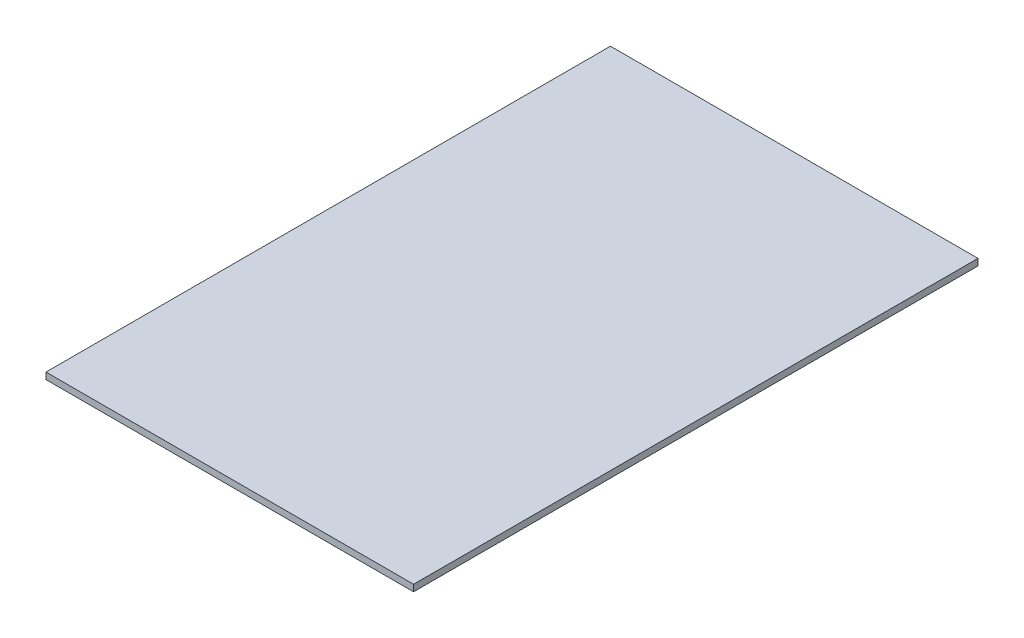
ISO-10303-21;
HEADER;
FILE_DESCRIPTION(('STEP AP214'),'2;1');
FILE_NAME('part.step','',(''),(''),'','','');
FILE_SCHEMA(('AUTOMOTIVE_DESIGN { 1 0 10303 214 1 1 1 1 }'));
ENDSEC;
DATA;
#1=APPLICATION_CONTEXT('core data for automotive mechanical design processes');
#2=APPLICATION_PROTOCOL_DEFINITION('international standard','automotive_design',2000,#1);
#3=PRODUCT_CONTEXT('',#1,'mechanical');
#4=PRODUCT('Part','Part','',(#3));
#5=PRODUCT_RELATED_PRODUCT_CATEGORY('part','',(#4));
#6=PRODUCT_DEFINITION_FORMATION('','',#4);
#7=PRODUCT_DEFINITION_CONTEXT('part definition',#1,'design');
#8=PRODUCT_DEFINITION('design','',#6,#7);
#9=PRODUCT_DEFINITION_SHAPE('','',#8);
#10=(LENGTH_UNIT() NAMED_UNIT(*) SI_UNIT(.MILLI.,.METRE.));
#11=(NAMED_UNIT(*) PLANE_ANGLE_UNIT() SI_UNIT($,.RADIAN.));
#12=(NAMED_UNIT(*) SI_UNIT($,.STERADIAN.) SOLID_ANGLE_UNIT());
#13=UNCERTAINTY_MEASURE_WITH_UNIT(LENGTH_MEASURE(1.E-05),#10,'distance_accuracy_value','');
#14=(GEOMETRIC_REPRESENTATION_CONTEXT(3) GLOBAL_UNCERTAINTY_ASSIGNED_CONTEXT((#13)) GLOBAL_UNIT_ASSIGNED_CONTEXT((#10,
#11,#12)) REPRESENTATION_CONTEXT('',''));
#15=CARTESIAN_POINT('',(0.,0.,0.));
#16=DIRECTION('',(0.,0.,1.));
#17=DIRECTION('',(1.,0.,0.));
#18=AXIS2_PLACEMENT_3D('',#15,#16,#17);
#19=CARTESIAN_POINT('',(0.,0.,0.));
#20=DIRECTION('',(0.,-1.,0.));
#21=DIRECTION('',(0.,0.,-1.));
#22=AXIS2_PLACEMENT_3D('',#19,#20,#21);
#23=PLANE('',#22);
#24=DIRECTION('',(-1.,0.,0.));
#25=VECTOR('',#24,1.);
#26=CARTESIAN_POINT('',(0.,0.,-77.5));
#27=LINE('',#26,#25);
#28=CARTESIAN_POINT('',(70.,0.,-77.5));
#29=VERTEX_POINT('',#28);
#30=CARTESIAN_POINT('',(-70.,0.,-77.5));
#31=VERTEX_POINT('',#30);
#32=EDGE_CURVE('E141',#29,#31,#27,.T.);
#33=ORIENTED_EDGE('',*,*,#32,.F.);
#34=DIRECTION('',(0.,0.,-1.));
#35=VECTOR('',#34,1.);
#36=CARTESIAN_POINT('',(70.,0.,137.5));
#37=LINE('',#36,#35);
#38=CARTESIAN_POINT('',(70.,0.,137.5));
#39=VERTEX_POINT('',#38);
#40=EDGE_CURVE('E140',#39,#29,#37,.T.);
#41=ORIENTED_EDGE('',*,*,#40,.F.);
#42=DIRECTION('',(1.,0.,0.));
#43=VECTOR('',#42,1.);
#44=CARTESIAN_POINT('',(-70.,0.,137.5));
#45=LINE('',#44,#43);
#46=CARTESIAN_POINT('',(-70.,0.,137.5));
#47=VERTEX_POINT('',#46);
#48=EDGE_CURVE('E148',#47,#39,#45,.T.);
#49=ORIENTED_EDGE('',*,*,#48,.F.);
#50=DIRECTION('',(0.,0.,1.));
#51=VECTOR('',#50,1.);
#52=CARTESIAN_POINT('',(-70.,0.,137.5));
#53=LINE('',#52,#51);
#54=EDGE_CURVE('E151',#31,#47,#53,.T.);
#55=ORIENTED_EDGE('',*,*,#54,.F.);
#56=EDGE_LOOP('',(#33,#41,#49,#55));
#57=FACE_BOUND('',#56,.T.);
#58=DIRECTION('',(1.,0.,0.));
#59=VECTOR('',#58,1.);
#60=CARTESIAN_POINT('',(-56.,0.,-18.));
#61=LINE('',#60,#59);
#62=CARTESIAN_POINT('',(-56.,0.,-18.));
#63=VERTEX_POINT('',#62);
#64=CARTESIAN_POINT('',(-14.,0.,-18.));
#65=VERTEX_POINT('',#64);
#66=EDGE_CURVE('E208',#63,#65,#61,.T.);
#67=ORIENTED_EDGE('',*,*,#66,.F.);
#68=DIRECTION('',(0.,0.,-1.));
#69=VECTOR('',#68,1.);
#70=CARTESIAN_POINT('',(-56.,0.,-18.));
#71=LINE('',#70,#69);
#72=CARTESIAN_POINT('',(-56.,0.,18.));
#73=VERTEX_POINT('',#72);
#74=EDGE_CURVE('E194',#73,#63,#71,.T.);
#75=ORIENTED_EDGE('',*,*,#74,.F.);
#76=DIRECTION('',(-1.,0.,0.));
#77=VECTOR('',#76,1.);
#78=CARTESIAN_POINT('',(-56.,0.,18.));
#79=LINE('',#78,#77);
#80=CARTESIAN_POINT('',(-14.,0.,18.));
#81=VERTEX_POINT('',#80);
#82=EDGE_CURVE('E199',#81,#73,#79,.T.);
#83=ORIENTED_EDGE('',*,*,#82,.F.);
#84=DIRECTION('',(0.,0.,1.));
#85=VECTOR('',#84,1.);
#86=CARTESIAN_POINT('',(-14.,0.,-18.));
#87=LINE('',#86,#85);
#88=EDGE_CURVE('E210',#65,#81,#87,.T.);
#89=ORIENTED_EDGE('',*,*,#88,.F.);
#90=EDGE_LOOP('',(#67,#75,#83,#89));
#91=FACE_BOUND('',#90,.T.);
#92=DIRECTION('',(0.,0.,1.));
#93=VECTOR('',#92,1.);
#94=CARTESIAN_POINT('',(56.,0.,-18.));
#95=LINE('',#94,#93);
#96=CARTESIAN_POINT('',(56.,0.,-18.));
#97=VERTEX_POINT('',#96);
#98=CARTESIAN_POINT('',(56.,0.,18.));
#99=VERTEX_POINT('',#98);
#100=EDGE_CURVE('E167',#97,#99,#95,.T.);
#101=ORIENTED_EDGE('',*,*,#100,.F.);
#102=DIRECTION('',(1.,0.,0.));
#103=VECTOR('',#102,1.);
#104=CARTESIAN_POINT('',(56.,0.,-18.));
#105=LINE('',#104,#103);
#106=CARTESIAN_POINT('',(14.,0.,-18.));
#107=VERTEX_POINT('',#106);
#108=EDGE_CURVE('E164',#107,#97,#105,.T.);
#109=ORIENTED_EDGE('',*,*,#108,.F.);
#110=DIRECTION('',(0.,0.,-1.));
#111=VECTOR('',#110,1.);
#112=CARTESIAN_POINT('',(14.,0.,-18.));
#113=LINE('',#112,#111);
#114=CARTESIAN_POINT('',(14.,0.,18.));
#115=VERTEX_POINT('',#114);
#116=EDGE_CURVE('E175',#115,#107,#113,.T.);
#117=ORIENTED_EDGE('',*,*,#116,.F.);
#118=DIRECTION('',(-1.,0.,0.));
#119=VECTOR('',#118,1.);
#120=CARTESIAN_POINT('',(56.,0.,18.));
#121=LINE('',#120,#119);
#122=EDGE_CURVE('E183',#99,#115,#121,.T.);
#123=ORIENTED_EDGE('',*,*,#122,.F.);
#124=EDGE_LOOP('',(#101,#109,#117,#123));
#125=FACE_BOUND('',#124,.T.);
#126=ADVANCED_FACE('F38',(#57,#91,#125),#23,.T.);
#127=CARTESIAN_POINT('',(70.,2.5,137.5));
#128=DIRECTION('',(-1.,0.,0.));
#129=DIRECTION('',(0.,0.,1.));
#130=AXIS2_PLACEMENT_3D('',#127,#128,#129);
#131=PLANE('',#130);
#132=ORIENTED_EDGE('',*,*,#40,.T.);
#133=DIRECTION('',(0.,1.,0.));
#134=VECTOR('',#133,1.);
#135=CARTESIAN_POINT('',(70.,-1.,-77.5));
#136=LINE('',#135,#134);
#137=CARTESIAN_POINT('',(70.,2.5,-77.5));
#138=VERTEX_POINT('',#137);
#139=EDGE_CURVE('E128',#29,#138,#136,.T.);
#140=ORIENTED_EDGE('',*,*,#139,.T.);
#141=DIRECTION('',(0.,0.,-1.));
#142=VECTOR('',#141,1.);
#143=CARTESIAN_POINT('',(70.,2.5,137.5));
#144=LINE('',#143,#142);
#145=CARTESIAN_POINT('',(70.,2.5,137.5));
#146=VERTEX_POINT('',#145);
#147=EDGE_CURVE('E138',#146,#138,#144,.T.);
#148=ORIENTED_EDGE('',*,*,#147,.F.);
#149=DIRECTION('',(0.,-1.,0.));
#150=VECTOR('',#149,1.);
#151=CARTESIAN_POINT('',(70.,2.5,137.5));
#152=LINE('',#151,#150);
#153=EDGE_CURVE('E46',#146,#39,#152,.T.);
#154=ORIENTED_EDGE('',*,*,#153,.T.);
#155=EDGE_LOOP('',(#132,#140,#148,#154));
#156=FACE_BOUND('',#155,.T.);
#157=ADVANCED_FACE('F40',(#156),#131,.F.);
#158=CARTESIAN_POINT('',(-70.,2.5,137.5));
#159=DIRECTION('',(1.,0.,0.));
#160=DIRECTION('',(0.,0.,-1.));
#161=AXIS2_PLACEMENT_3D('',#158,#159,#160);
#162=PLANE('',#161);
#163=DIRECTION('',(0.,0.,1.));
#164=VECTOR('',#163,1.);
#165=CARTESIAN_POINT('',(-70.,2.5,137.5));
#166=LINE('',#165,#164);
#167=CARTESIAN_POINT('',(-70.,2.5,-77.5));
#168=VERTEX_POINT('',#167);
#169=CARTESIAN_POINT('',(-70.,2.5,137.5));
#170=VERTEX_POINT('',#169);
#171=EDGE_CURVE('E147',#168,#170,#166,.T.);
#172=ORIENTED_EDGE('',*,*,#171,.F.);
#173=DIRECTION('',(0.,1.,0.));
#174=VECTOR('',#173,1.);
#175=CARTESIAN_POINT('',(-70.,-1.,-77.5));
#176=LINE('',#175,#174);
#177=EDGE_CURVE('E53',#31,#168,#176,.T.);
#178=ORIENTED_EDGE('',*,*,#177,.F.);
#179=ORIENTED_EDGE('',*,*,#54,.T.);
#180=DIRECTION('',(0.,-1.,0.));
#181=VECTOR('',#180,1.);
#182=CARTESIAN_POINT('',(-70.,2.5,137.5));
#183=LINE('',#182,#181);
#184=EDGE_CURVE('E11',#170,#47,#183,.T.);
#185=ORIENTED_EDGE('',*,*,#184,.F.);
#186=EDGE_LOOP('',(#172,#178,#179,#185));
#187=FACE_BOUND('',#186,.T.);
#188=ADVANCED_FACE('F257',(#187),#162,.F.);
#189=CARTESIAN_POINT('',(-70.,2.5,137.5));
#190=DIRECTION('',(0.,0.,-1.));
#191=DIRECTION('',(-1.,0.,0.));
#192=AXIS2_PLACEMENT_3D('',#189,#190,#191);
#193=PLANE('',#192);
#194=ORIENTED_EDGE('',*,*,#48,.T.);
#195=ORIENTED_EDGE('',*,*,#153,.F.);
#196=DIRECTION('',(1.,0.,0.));
#197=VECTOR('',#196,1.);
#198=CARTESIAN_POINT('',(-70.,2.5,137.5));
#199=LINE('',#198,#197);
#200=EDGE_CURVE('E145',#170,#146,#199,.T.);
#201=ORIENTED_EDGE('',*,*,#200,.F.);
#202=ORIENTED_EDGE('',*,*,#184,.T.);
#203=EDGE_LOOP('',(#194,#195,#201,#202));
#204=FACE_BOUND('',#203,.T.);
#205=ADVANCED_FACE('F261',(#204),#193,.F.);
#206=CARTESIAN_POINT('',(0.,2.5,0.));
#207=DIRECTION('',(0.,-1.,0.));
#208=DIRECTION('',(0.,0.,-1.));
#209=AXIS2_PLACEMENT_3D('',#206,#207,#208);
#210=PLANE('',#209);
#211=ORIENTED_EDGE('',*,*,#147,.T.);
#212=DIRECTION('',(1.,0.,0.));
#213=VECTOR('',#212,1.);
#214=CARTESIAN_POINT('',(-70.,2.5,-77.5));
#215=LINE('',#214,#213);
#216=EDGE_CURVE('E125',#168,#138,#215,.T.);
#217=ORIENTED_EDGE('',*,*,#216,.F.);
#218=ORIENTED_EDGE('',*,*,#171,.T.);
#219=ORIENTED_EDGE('',*,*,#200,.T.);
#220=EDGE_LOOP('',(#211,#217,#218,#219));
#221=FACE_BOUND('',#220,.T.);
#222=ADVANCED_FACE('F143',(#221),#210,.F.);
#223=CARTESIAN_POINT('',(-56.,-1.,-18.));
#224=DIRECTION('',(1.,0.,0.));
#225=DIRECTION('',(0.,0.,-1.));
#226=AXIS2_PLACEMENT_3D('',#223,#224,#225);
#227=PLANE('',#226);
#228=ORIENTED_EDGE('',*,*,#74,.T.);
#229=DIRECTION('',(0.,1.,0.));
#230=VECTOR('',#229,1.);
#231=CARTESIAN_POINT('',(-56.,-1.,-18.));
#232=LINE('',#231,#230);
#233=CARTESIAN_POINT('',(-56.,-1.,-18.));
#234=VERTEX_POINT('',#233);
#235=EDGE_CURVE('E154',#234,#63,#232,.T.);
#236=ORIENTED_EDGE('',*,*,#235,.F.);
#237=DIRECTION('',(0.,0.,-1.));
#238=VECTOR('',#237,1.);
#239=CARTESIAN_POINT('',(-56.,-1.,-18.));
#240=LINE('',#239,#238);
#241=CARTESIAN_POINT('',(-56.,-1.,18.));
#242=VERTEX_POINT('',#241);
#243=EDGE_CURVE('E195',#242,#234,#240,.T.);
#244=ORIENTED_EDGE('',*,*,#243,.F.);
#245=DIRECTION('',(0.,1.,0.));
#246=VECTOR('',#245,1.);
#247=CARTESIAN_POINT('',(-56.,-1.,18.));
#248=LINE('',#247,#246);
#249=EDGE_CURVE('E205',#242,#73,#248,.T.);
#250=ORIENTED_EDGE('',*,*,#249,.T.);
#251=EDGE_LOOP('',(#228,#236,#244,#250));
#252=FACE_BOUND('',#251,.T.);
#253=ADVANCED_FACE('F230',(#252),#227,.F.);
#254=CARTESIAN_POINT('',(-56.,-1.,-18.));
#255=DIRECTION('',(0.,0.,1.));
#256=DIRECTION('',(1.,0.,0.));
#257=AXIS2_PLACEMENT_3D('',#254,#255,#256);
#258=PLANE('',#257);
#259=ORIENTED_EDGE('',*,*,#66,.T.);
#260=DIRECTION('',(0.,1.,0.));
#261=VECTOR('',#260,1.);
#262=CARTESIAN_POINT('',(-14.,-1.,-18.));
#263=LINE('',#262,#261);
#264=CARTESIAN_POINT('',(-14.,-1.,-18.));
#265=VERTEX_POINT('',#264);
#266=EDGE_CURVE('E217',#265,#65,#263,.T.);
#267=ORIENTED_EDGE('',*,*,#266,.F.);
#268=DIRECTION('',(1.,0.,0.));
#269=VECTOR('',#268,1.);
#270=CARTESIAN_POINT('',(-56.,-1.,-18.));
#271=LINE('',#270,#269);
#272=EDGE_CURVE('E198',#234,#265,#271,.T.);
#273=ORIENTED_EDGE('',*,*,#272,.F.);
#274=ORIENTED_EDGE('',*,*,#235,.T.);
#275=EDGE_LOOP('',(#259,#267,#273,#274));
#276=FACE_BOUND('',#275,.T.);
#277=ADVANCED_FACE('F225',(#276),#258,.F.);
#278=CARTESIAN_POINT('',(-14.,-1.,-18.));
#279=DIRECTION('',(-1.,0.,0.));
#280=DIRECTION('',(0.,0.,1.));
#281=AXIS2_PLACEMENT_3D('',#278,#279,#280);
#282=PLANE('',#281);
#283=ORIENTED_EDGE('',*,*,#88,.T.);
#284=DIRECTION('',(0.,1.,0.));
#285=VECTOR('',#284,1.);
#286=CARTESIAN_POINT('',(-14.,-1.,18.));
#287=LINE('',#286,#285);
#288=CARTESIAN_POINT('',(-14.,-1.,18.));
#289=VERTEX_POINT('',#288);
#290=EDGE_CURVE('E216',#289,#81,#287,.T.);
#291=ORIENTED_EDGE('',*,*,#290,.F.);
#292=DIRECTION('',(0.,0.,1.));
#293=VECTOR('',#292,1.);
#294=CARTESIAN_POINT('',(-14.,-1.,-18.));
#295=LINE('',#294,#293);
#296=EDGE_CURVE('E201',#265,#289,#295,.T.);
#297=ORIENTED_EDGE('',*,*,#296,.F.);
#298=ORIENTED_EDGE('',*,*,#266,.T.);
#299=EDGE_LOOP('',(#283,#291,#297,#298));
#300=FACE_BOUND('',#299,.T.);
#301=ADVANCED_FACE('F235',(#300),#282,.F.);
#302=CARTESIAN_POINT('',(-56.,-1.,18.));
#303=DIRECTION('',(0.,0.,-1.));
#304=DIRECTION('',(-1.,0.,0.));
#305=AXIS2_PLACEMENT_3D('',#302,#303,#304);
#306=PLANE('',#305);
#307=ORIENTED_EDGE('',*,*,#82,.T.);
#308=ORIENTED_EDGE('',*,*,#249,.F.);
#309=DIRECTION('',(-1.,0.,0.));
#310=VECTOR('',#309,1.);
#311=CARTESIAN_POINT('',(-56.,-1.,18.));
#312=LINE('',#311,#310);
#313=EDGE_CURVE('E203',#289,#242,#312,.T.);
#314=ORIENTED_EDGE('',*,*,#313,.F.);
#315=ORIENTED_EDGE('',*,*,#290,.T.);
#316=EDGE_LOOP('',(#307,#308,#314,#315));
#317=FACE_BOUND('',#316,.T.);
#318=ADVANCED_FACE('F238',(#317),#306,.F.);
#319=CARTESIAN_POINT('',(0.,-1.,0.));
#320=DIRECTION('',(0.,1.,0.));
#321=DIRECTION('',(0.,0.,1.));
#322=AXIS2_PLACEMENT_3D('',#319,#320,#321);
#323=PLANE('',#322);
#324=ORIENTED_EDGE('',*,*,#243,.T.);
#325=ORIENTED_EDGE('',*,*,#272,.T.);
#326=ORIENTED_EDGE('',*,*,#296,.T.);
#327=ORIENTED_EDGE('',*,*,#313,.T.);
#328=EDGE_LOOP('',(#324,#325,#326,#327));
#329=FACE_BOUND('',#328,.T.);
#330=ADVANCED_FACE('F240',(#329),#323,.F.);
#331=CARTESIAN_POINT('',(56.,-1.,-18.));
#332=DIRECTION('',(0.,0.,1.));
#333=DIRECTION('',(1.,0.,0.));
#334=AXIS2_PLACEMENT_3D('',#331,#332,#333);
#335=PLANE('',#334);
#336=ORIENTED_EDGE('',*,*,#108,.T.);
#337=DIRECTION('',(0.,1.,0.));
#338=VECTOR('',#337,1.);
#339=CARTESIAN_POINT('',(56.,-1.,-18.));
#340=LINE('',#339,#338);
#341=CARTESIAN_POINT('',(56.,-1.,-18.));
#342=VERTEX_POINT('',#341);
#343=EDGE_CURVE('E192',#342,#97,#340,.T.);
#344=ORIENTED_EDGE('',*,*,#343,.F.);
#345=DIRECTION('',(1.,0.,0.));
#346=VECTOR('',#345,1.);
#347=CARTESIAN_POINT('',(56.,-1.,-18.));
#348=LINE('',#347,#346);
#349=CARTESIAN_POINT('',(14.,-1.,-18.));
#350=VERTEX_POINT('',#349);
#351=EDGE_CURVE('E171',#350,#342,#348,.T.);
#352=ORIENTED_EDGE('',*,*,#351,.F.);
#353=DIRECTION('',(0.,1.,0.));
#354=VECTOR('',#353,1.);
#355=CARTESIAN_POINT('',(14.,-1.,-18.));
#356=LINE('',#355,#354);
#357=EDGE_CURVE('E180',#350,#107,#356,.T.);
#358=ORIENTED_EDGE('',*,*,#357,.T.);
#359=EDGE_LOOP('',(#336,#344,#352,#358));
#360=FACE_BOUND('',#359,.T.);
#361=ADVANCED_FACE('F242',(#360),#335,.F.);
#362=CARTESIAN_POINT('',(56.,-1.,-18.));
#363=DIRECTION('',(-1.,0.,0.));
#364=DIRECTION('',(0.,0.,1.));
#365=AXIS2_PLACEMENT_3D('',#362,#363,#364);
#366=PLANE('',#365);
#367=ORIENTED_EDGE('',*,*,#100,.T.);
#368=DIRECTION('',(0.,1.,0.));
#369=VECTOR('',#368,1.);
#370=CARTESIAN_POINT('',(56.,-1.,18.));
#371=LINE('',#370,#369);
#372=CARTESIAN_POINT('',(56.,-1.,18.));
#373=VERTEX_POINT('',#372);
#374=EDGE_CURVE('E189',#373,#99,#371,.T.);
#375=ORIENTED_EDGE('',*,*,#374,.F.);
#376=DIRECTION('',(0.,0.,1.));
#377=VECTOR('',#376,1.);
#378=CARTESIAN_POINT('',(56.,-1.,-18.));
#379=LINE('',#378,#377);
#380=EDGE_CURVE('E174',#342,#373,#379,.T.);
#381=ORIENTED_EDGE('',*,*,#380,.F.);
#382=ORIENTED_EDGE('',*,*,#343,.T.);
#383=EDGE_LOOP('',(#367,#375,#381,#382));
#384=FACE_BOUND('',#383,.T.);
#385=ADVANCED_FACE('F248',(#384),#366,.F.);
#386=CARTESIAN_POINT('',(56.,-1.,18.));
#387=DIRECTION('',(0.,0.,-1.));
#388=DIRECTION('',(-1.,0.,0.));
#389=AXIS2_PLACEMENT_3D('',#386,#387,#388);
#390=PLANE('',#389);
#391=ORIENTED_EDGE('',*,*,#122,.T.);
#392=DIRECTION('',(0.,1.,0.));
#393=VECTOR('',#392,1.);
#394=CARTESIAN_POINT('',(14.,-1.,18.));
#395=LINE('',#394,#393);
#396=CARTESIAN_POINT('',(14.,-1.,18.));
#397=VERTEX_POINT('',#396);
#398=EDGE_CURVE('E61',#397,#115,#395,.T.);
#399=ORIENTED_EDGE('',*,*,#398,.F.);
#400=DIRECTION('',(-1.,0.,0.));
#401=VECTOR('',#400,1.);
#402=CARTESIAN_POINT('',(56.,-1.,18.));
#403=LINE('',#402,#401);
#404=EDGE_CURVE('E177',#373,#397,#403,.T.);
#405=ORIENTED_EDGE('',*,*,#404,.F.);
#406=ORIENTED_EDGE('',*,*,#374,.T.);
#407=EDGE_LOOP('',(#391,#399,#405,#406));
#408=FACE_BOUND('',#407,.T.);
#409=ADVANCED_FACE('F320',(#408),#390,.F.);
#410=CARTESIAN_POINT('',(14.,-1.,-18.));
#411=DIRECTION('',(1.,0.,0.));
#412=DIRECTION('',(0.,0.,-1.));
#413=AXIS2_PLACEMENT_3D('',#410,#411,#412);
#414=PLANE('',#413);
#415=ORIENTED_EDGE('',*,*,#116,.T.);
#416=ORIENTED_EDGE('',*,*,#357,.F.);
#417=DIRECTION('',(0.,0.,-1.));
#418=VECTOR('',#417,1.);
#419=CARTESIAN_POINT('',(14.,-1.,-18.));
#420=LINE('',#419,#418);
#421=EDGE_CURVE('E179',#397,#350,#420,.T.);
#422=ORIENTED_EDGE('',*,*,#421,.F.);
#423=ORIENTED_EDGE('',*,*,#398,.T.);
#424=EDGE_LOOP('',(#415,#416,#422,#423));
#425=FACE_BOUND('',#424,.T.);
#426=ADVANCED_FACE('F330',(#425),#414,.F.);
#427=CARTESIAN_POINT('',(0.,-1.,0.));
#428=DIRECTION('',(0.,1.,0.));
#429=DIRECTION('',(0.,0.,1.));
#430=AXIS2_PLACEMENT_3D('',#427,#428,#429);
#431=PLANE('',#430);
#432=ORIENTED_EDGE('',*,*,#351,.T.);
#433=ORIENTED_EDGE('',*,*,#380,.T.);
#434=ORIENTED_EDGE('',*,*,#404,.T.);
#435=ORIENTED_EDGE('',*,*,#421,.T.);
#436=EDGE_LOOP('',(#432,#433,#434,#435));
#437=FACE_BOUND('',#436,.T.);
#438=ADVANCED_FACE('F340',(#437),#431,.F.);
#439=CARTESIAN_POINT('',(-70.,-1.,-77.5));
#440=DIRECTION('',(0.,0.,1.));
#441=DIRECTION('',(1.,0.,0.));
#442=AXIS2_PLACEMENT_3D('',#439,#440,#441);
#443=PLANE('',#442);
#444=ORIENTED_EDGE('',*,*,#32,.T.);
#445=ORIENTED_EDGE('',*,*,#177,.T.);
#446=ORIENTED_EDGE('',*,*,#216,.T.);
#447=ORIENTED_EDGE('',*,*,#139,.F.);
#448=EDGE_LOOP('',(#444,#445,#446,#447));
#449=FACE_BOUND('',#448,.T.);
#450=ADVANCED_FACE('F127',(#449),#443,.F.);
#451=CLOSED_SHELL('',(#126,#157,#188,#205,#222,#253,#277,#301,#318,#330,#361,#385,#409,#426,
#438,#450));
#452=MANIFOLD_SOLID_BREP('B2',#451);
#453=ADVANCED_BREP_SHAPE_REPRESENTATION('',(#18,#452),#14);
#454=SHAPE_DEFINITION_REPRESENTATION(#9,#453);
ENDSEC;
END-ISO-10303-21;
